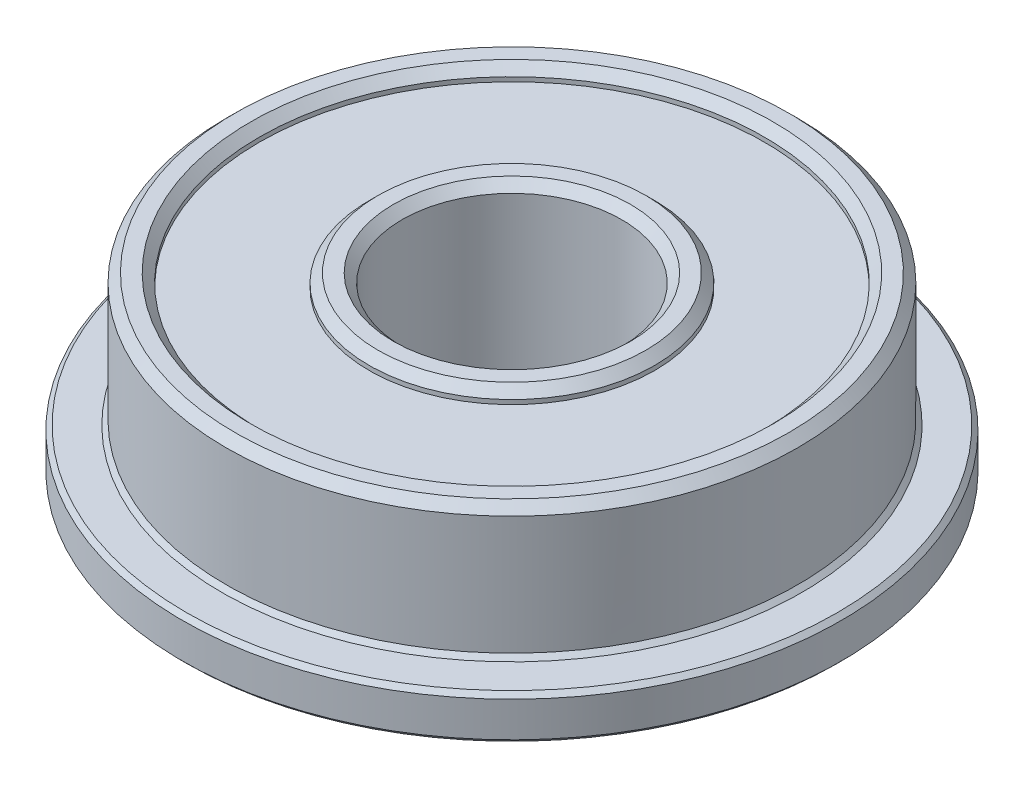
ISO-10303-21;
HEADER;
FILE_DESCRIPTION(('STEP AP214'),'2;1');
FILE_NAME('part.step','',(''),(''),'','','');
FILE_SCHEMA(('AUTOMOTIVE_DESIGN { 1 0 10303 214 1 1 1 1 }'));
ENDSEC;
DATA;
#1=APPLICATION_CONTEXT('core data for automotive mechanical design processes');
#2=APPLICATION_PROTOCOL_DEFINITION('international standard','automotive_design',2000,#1);
#3=PRODUCT_CONTEXT('',#1,'mechanical');
#4=PRODUCT('Part','Part','',(#3));
#5=PRODUCT_RELATED_PRODUCT_CATEGORY('part','',(#4));
#6=PRODUCT_DEFINITION_FORMATION('','',#4);
#7=PRODUCT_DEFINITION_CONTEXT('part definition',#1,'design');
#8=PRODUCT_DEFINITION('design','',#6,#7);
#9=PRODUCT_DEFINITION_SHAPE('','',#8);
#10=(LENGTH_UNIT() NAMED_UNIT(*) SI_UNIT(.MILLI.,.METRE.));
#11=(NAMED_UNIT(*) PLANE_ANGLE_UNIT() SI_UNIT($,.RADIAN.));
#12=(NAMED_UNIT(*) SI_UNIT($,.STERADIAN.) SOLID_ANGLE_UNIT());
#13=UNCERTAINTY_MEASURE_WITH_UNIT(LENGTH_MEASURE(1.E-05),#10,'distance_accuracy_value','');
#14=(GEOMETRIC_REPRESENTATION_CONTEXT(3) GLOBAL_UNCERTAINTY_ASSIGNED_CONTEXT((#13)) GLOBAL_UNIT_ASSIGNED_CONTEXT((#10,
#11,#12)) REPRESENTATION_CONTEXT('',''));
#15=CARTESIAN_POINT('',(0.,0.,0.));
#16=DIRECTION('',(0.,0.,1.));
#17=DIRECTION('',(1.,0.,0.));
#18=AXIS2_PLACEMENT_3D('',#15,#16,#17);
#19=CARTESIAN_POINT('',(0.,3.7,0.));
#20=DIRECTION('',(0.,1.,0.));
#21=DIRECTION('',(0.,0.,-1.));
#22=AXIS2_PLACEMENT_3D('',#19,#20,#21);
#23=PLANE('',#22);
#24=CARTESIAN_POINT('',(0.,3.7,0.));
#25=DIRECTION('',(0.,1.,0.));
#26=DIRECTION('',(-1.,0.,0.));
#27=AXIS2_PLACEMENT_3D('',#24,#25,#26);
#28=CIRCLE('',#27,3.25);
#29=CARTESIAN_POINT('',(3.25,3.7,0.));
#30=VERTEX_POINT('',#29);
#31=EDGE_CURVE('E133',#30,#30,#28,.T.);
#32=ORIENTED_EDGE('',*,*,#31,.F.);
#33=EDGE_LOOP('',(#32));
#34=FACE_BOUND('',#33,.T.);
#35=CARTESIAN_POINT('',(0.,3.7,0.));
#36=DIRECTION('',(0.,-1.,0.));
#37=DIRECTION('',(-1.,0.,0.));
#38=AXIS2_PLACEMENT_3D('',#35,#36,#37);
#39=CIRCLE('',#38,5.75);
#40=CARTESIAN_POINT('',(5.75,3.7,0.));
#41=VERTEX_POINT('',#40);
#42=EDGE_CURVE('E125',#41,#41,#39,.T.);
#43=ORIENTED_EDGE('',*,*,#42,.F.);
#44=EDGE_LOOP('',(#43));
#45=FACE_BOUND('',#44,.T.);
#46=ADVANCED_FACE('F18',(#34,#45),#23,.T.);
#47=CARTESIAN_POINT('',(0.,3.9,0.));
#48=DIRECTION('',(0.,1.,0.));
#49=DIRECTION('',(-1.,0.,0.));
#50=AXIS2_PLACEMENT_3D('',#47,#48,#49);
#51=CONICAL_SURFACE('',#50,2.6,0.785398163397448);
#52=CARTESIAN_POINT('',(0.,3.8,0.));
#53=DIRECTION('',(0.,-1.,0.));
#54=DIRECTION('',(-1.,0.,0.));
#55=AXIS2_PLACEMENT_3D('',#52,#53,#54);
#56=CIRCLE('',#55,2.5);
#57=CARTESIAN_POINT('',(2.5,3.8,0.));
#58=VERTEX_POINT('',#57);
#59=EDGE_CURVE('E462',#58,#58,#56,.T.);
#60=ORIENTED_EDGE('',*,*,#59,.T.);
#61=DIRECTION('',(0.707106781186547,0.707106781186548,0.));
#62=VECTOR('',#61,1.);
#63=CARTESIAN_POINT('',(2.6,3.9,0.));
#64=LINE('',#63,#62);
#65=CARTESIAN_POINT('',(2.7,4.,0.));
#66=VERTEX_POINT('',#65);
#67=EDGE_CURVE('E11',#58,#66,#64,.T.);
#68=ORIENTED_EDGE('',*,*,#67,.T.);
#69=CARTESIAN_POINT('',(0.,4.,0.));
#70=DIRECTION('',(0.,1.,0.));
#71=DIRECTION('',(-1.,0.,0.));
#72=AXIS2_PLACEMENT_3D('',#69,#70,#71);
#73=CIRCLE('',#72,2.7);
#74=EDGE_CURVE('E147',#66,#66,#73,.T.);
#75=ORIENTED_EDGE('',*,*,#74,.T.);
#76=ORIENTED_EDGE('',*,*,#67,.F.);
#77=EDGE_LOOP('',(#60,#68,#75,#76));
#78=FACE_BOUND('',#77,.T.);
#79=ADVANCED_FACE('F353',(#78),#51,.F.);
#80=CARTESIAN_POINT('',(0.,4.,0.));
#81=DIRECTION('',(0.,-1.,0.));
#82=DIRECTION('',(-1.,0.,0.));
#83=AXIS2_PLACEMENT_3D('',#80,#81,#82);
#84=CYLINDRICAL_SURFACE('',#83,3.25);
#85=ORIENTED_EDGE('',*,*,#31,.T.);
#86=DIRECTION('',(0.,1.,0.));
#87=VECTOR('',#86,1.);
#88=CARTESIAN_POINT('',(3.25,4.,0.));
#89=LINE('',#88,#87);
#90=CARTESIAN_POINT('',(3.25,3.8,0.));
#91=VERTEX_POINT('',#90);
#92=EDGE_CURVE('E27',#30,#91,#89,.T.);
#93=ORIENTED_EDGE('',*,*,#92,.T.);
#94=CARTESIAN_POINT('',(0.,3.8,0.));
#95=DIRECTION('',(0.,1.,0.));
#96=DIRECTION('',(-1.,0.,0.));
#97=AXIS2_PLACEMENT_3D('',#94,#95,#96);
#98=CIRCLE('',#97,3.25);
#99=EDGE_CURVE('E131',#91,#91,#98,.T.);
#100=ORIENTED_EDGE('',*,*,#99,.F.);
#101=ORIENTED_EDGE('',*,*,#92,.F.);
#102=EDGE_LOOP('',(#85,#93,#100,#101));
#103=FACE_BOUND('',#102,.T.);
#104=ADVANCED_FACE('F129',(#103),#84,.T.);
#105=CARTESIAN_POINT('',(0.,4.,0.));
#106=DIRECTION('',(0.,1.,0.));
#107=DIRECTION('',(0.,0.,-1.));
#108=AXIS2_PLACEMENT_3D('',#105,#106,#107);
#109=PLANE('',#108);
#110=ORIENTED_EDGE('',*,*,#74,.F.);
#111=EDGE_LOOP('',(#110));
#112=FACE_BOUND('',#111,.T.);
#113=CARTESIAN_POINT('',(0.,4.,0.));
#114=DIRECTION('',(0.,-1.,0.));
#115=DIRECTION('',(-1.,0.,0.));
#116=AXIS2_PLACEMENT_3D('',#113,#114,#115);
#117=CIRCLE('',#116,3.05);
#118=CARTESIAN_POINT('',(3.05,4.,0.));
#119=VERTEX_POINT('',#118);
#120=EDGE_CURVE('E140',#119,#119,#117,.T.);
#121=ORIENTED_EDGE('',*,*,#120,.F.);
#122=EDGE_LOOP('',(#121));
#123=FACE_BOUND('',#122,.T.);
#124=ADVANCED_FACE('F337',(#112,#123),#109,.T.);
#125=CARTESIAN_POINT('',(0.,3.9,0.));
#126=DIRECTION('',(0.,-1.,0.));
#127=DIRECTION('',(-1.,0.,0.));
#128=AXIS2_PLACEMENT_3D('',#125,#126,#127);
#129=CONICAL_SURFACE('',#128,3.15,0.785398163397448);
#130=ORIENTED_EDGE('',*,*,#99,.T.);
#131=DIRECTION('',(-0.707106781186547,0.707106781186548,0.));
#132=VECTOR('',#131,1.);
#133=CARTESIAN_POINT('',(3.15,3.9,0.));
#134=LINE('',#133,#132);
#135=EDGE_CURVE('E137',#91,#119,#134,.T.);
#136=ORIENTED_EDGE('',*,*,#135,.T.);
#137=ORIENTED_EDGE('',*,*,#120,.T.);
#138=ORIENTED_EDGE('',*,*,#135,.F.);
#139=EDGE_LOOP('',(#130,#136,#137,#138));
#140=FACE_BOUND('',#139,.T.);
#141=ADVANCED_FACE('F138',(#140),#129,.T.);
#142=CARTESIAN_POINT('',(0.,4.,0.));
#143=DIRECTION('',(0.,-1.,0.));
#144=DIRECTION('',(-1.,0.,0.));
#145=AXIS2_PLACEMENT_3D('',#142,#143,#144);
#146=CYLINDRICAL_SURFACE('',#145,5.75);
#147=CARTESIAN_POINT('',(0.,3.8,0.));
#148=DIRECTION('',(0.,-1.,0.));
#149=DIRECTION('',(-1.,0.,0.));
#150=AXIS2_PLACEMENT_3D('',#147,#148,#149);
#151=CIRCLE('',#150,5.75);
#152=CARTESIAN_POINT('',(5.75,3.8,0.));
#153=VERTEX_POINT('',#152);
#154=EDGE_CURVE('E425',#153,#153,#151,.T.);
#155=ORIENTED_EDGE('',*,*,#154,.F.);
#156=DIRECTION('',(0.,-1.,0.));
#157=VECTOR('',#156,1.);
#158=CARTESIAN_POINT('',(5.75,4.,0.));
#159=LINE('',#158,#157);
#160=EDGE_CURVE('E424',#153,#41,#159,.T.);
#161=ORIENTED_EDGE('',*,*,#160,.T.);
#162=ORIENTED_EDGE('',*,*,#42,.T.);
#163=ORIENTED_EDGE('',*,*,#160,.F.);
#164=EDGE_LOOP('',(#155,#161,#162,#163));
#165=FACE_BOUND('',#164,.T.);
#166=ADVANCED_FACE('F321',(#165),#146,.F.);
#167=CARTESIAN_POINT('',(0.,3.9,0.));
#168=DIRECTION('',(0.,1.,0.));
#169=DIRECTION('',(-1.,0.,0.));
#170=AXIS2_PLACEMENT_3D('',#167,#168,#169);
#171=CONICAL_SURFACE('',#170,5.85,0.785398163397448);
#172=ORIENTED_EDGE('',*,*,#154,.T.);
#173=DIRECTION('',(0.707106781186547,0.707106781186548,0.));
#174=VECTOR('',#173,1.);
#175=CARTESIAN_POINT('',(5.85,3.9,0.));
#176=LINE('',#175,#174);
#177=CARTESIAN_POINT('',(5.95,4.,0.));
#178=VERTEX_POINT('',#177);
#179=EDGE_CURVE('E421',#153,#178,#176,.T.);
#180=ORIENTED_EDGE('',*,*,#179,.T.);
#181=CARTESIAN_POINT('',(0.,4.,0.));
#182=DIRECTION('',(0.,1.,0.));
#183=DIRECTION('',(-1.,0.,0.));
#184=AXIS2_PLACEMENT_3D('',#181,#182,#183);
#185=CIRCLE('',#184,5.95);
#186=EDGE_CURVE('E499',#178,#178,#185,.T.);
#187=ORIENTED_EDGE('',*,*,#186,.T.);
#188=ORIENTED_EDGE('',*,*,#179,.F.);
#189=EDGE_LOOP('',(#172,#180,#187,#188));
#190=FACE_BOUND('',#189,.T.);
#191=ADVANCED_FACE('F312',(#190),#171,.F.);
#192=CARTESIAN_POINT('',(0.,4.,0.));
#193=DIRECTION('',(0.,1.,0.));
#194=DIRECTION('',(0.,0.,-1.));
#195=AXIS2_PLACEMENT_3D('',#192,#193,#194);
#196=PLANE('',#195);
#197=ORIENTED_EDGE('',*,*,#186,.F.);
#198=EDGE_LOOP('',(#197));
#199=FACE_BOUND('',#198,.T.);
#200=CARTESIAN_POINT('',(0.,4.,0.));
#201=DIRECTION('',(0.,-1.,0.));
#202=DIRECTION('',(-1.,0.,0.));
#203=AXIS2_PLACEMENT_3D('',#200,#201,#202);
#204=CIRCLE('',#203,6.3);
#205=CARTESIAN_POINT('',(6.3,4.,0.));
#206=VERTEX_POINT('',#205);
#207=EDGE_CURVE('E496',#206,#206,#204,.T.);
#208=ORIENTED_EDGE('',*,*,#207,.F.);
#209=EDGE_LOOP('',(#208));
#210=FACE_BOUND('',#209,.T.);
#211=ADVANCED_FACE('F303',(#199,#210),#196,.T.);
#212=CARTESIAN_POINT('',(0.,3.9,0.));
#213=DIRECTION('',(0.,-1.,0.));
#214=DIRECTION('',(-1.,0.,0.));
#215=AXIS2_PLACEMENT_3D('',#212,#213,#214);
#216=CONICAL_SURFACE('',#215,6.4,0.785398163397448);
#217=CARTESIAN_POINT('',(0.,3.8,0.));
#218=DIRECTION('',(0.,1.,0.));
#219=DIRECTION('',(-1.,0.,0.));
#220=AXIS2_PLACEMENT_3D('',#217,#218,#219);
#221=CIRCLE('',#220,6.5);
#222=CARTESIAN_POINT('',(6.5,3.8,0.));
#223=VERTEX_POINT('',#222);
#224=CARTESIAN_POINT('',(-6.5,3.8,0.));
#225=VERTEX_POINT('',#224);
#226=EDGE_CURVE('E402',#223,#225,#221,.T.);
#227=ORIENTED_EDGE('',*,*,#226,.T.);
#228=CARTESIAN_POINT('',(0.,3.8,0.));
#229=DIRECTION('',(0.,1.,0.));
#230=DIRECTION('',(-1.,0.,0.));
#231=AXIS2_PLACEMENT_3D('',#228,#229,#230);
#232=CIRCLE('',#231,6.5);
#233=EDGE_CURVE('E388',#225,#223,#232,.T.);
#234=ORIENTED_EDGE('',*,*,#233,.T.);
#235=DIRECTION('',(-0.707106781186547,0.707106781186548,0.));
#236=VECTOR('',#235,1.);
#237=CARTESIAN_POINT('',(6.4,3.9,0.));
#238=LINE('',#237,#236);
#239=EDGE_CURVE('E492',#223,#206,#238,.T.);
#240=ORIENTED_EDGE('',*,*,#239,.T.);
#241=ORIENTED_EDGE('',*,*,#207,.T.);
#242=ORIENTED_EDGE('',*,*,#239,.F.);
#243=EDGE_LOOP('',(#227,#234,#240,#241,#242));
#244=FACE_BOUND('',#243,.T.);
#245=ADVANCED_FACE('F261',(#244),#216,.T.);
#246=CARTESIAN_POINT('',(0.,0.3,0.));
#247=DIRECTION('',(0.,-1.,0.));
#248=DIRECTION('',(0.,0.,-1.));
#249=AXIS2_PLACEMENT_3D('',#246,#247,#248);
#250=PLANE('',#249);
#251=CARTESIAN_POINT('',(0.,0.3,0.));
#252=DIRECTION('',(0.,-1.,0.));
#253=DIRECTION('',(1.,0.,0.));
#254=AXIS2_PLACEMENT_3D('',#251,#252,#253);
#255=CIRCLE('',#254,3.25);
#256=CARTESIAN_POINT('',(-3.25,0.3,0.));
#257=VERTEX_POINT('',#256);
#258=EDGE_CURVE('E476',#257,#257,#255,.T.);
#259=ORIENTED_EDGE('',*,*,#258,.F.);
#260=EDGE_LOOP('',(#259));
#261=FACE_BOUND('',#260,.T.);
#262=CARTESIAN_POINT('',(0.,0.3,0.));
#263=DIRECTION('',(0.,1.,0.));
#264=DIRECTION('',(1.,0.,0.));
#265=AXIS2_PLACEMENT_3D('',#262,#263,#264);
#266=CIRCLE('',#265,5.75);
#267=CARTESIAN_POINT('',(-5.75,0.3,0.));
#268=VERTEX_POINT('',#267);
#269=EDGE_CURVE('E489',#268,#268,#266,.T.);
#270=ORIENTED_EDGE('',*,*,#269,.F.);
#271=EDGE_LOOP('',(#270));
#272=FACE_BOUND('',#271,.T.);
#273=ADVANCED_FACE('F188',(#261,#272),#250,.T.);
#274=CARTESIAN_POINT('',(0.,0.,0.));
#275=DIRECTION('',(0.,1.,0.));
#276=DIRECTION('',(1.,0.,0.));
#277=AXIS2_PLACEMENT_3D('',#274,#275,#276);
#278=CYLINDRICAL_SURFACE('',#277,5.75);
#279=CARTESIAN_POINT('',(0.,0.2,0.));
#280=DIRECTION('',(0.,1.,0.));
#281=DIRECTION('',(1.,0.,0.));
#282=AXIS2_PLACEMENT_3D('',#279,#280,#281);
#283=CIRCLE('',#282,5.75);
#284=CARTESIAN_POINT('',(-5.75,0.2,0.));
#285=VERTEX_POINT('',#284);
#286=EDGE_CURVE('E412',#285,#285,#283,.T.);
#287=ORIENTED_EDGE('',*,*,#286,.F.);
#288=DIRECTION('',(0.,1.,0.));
#289=VECTOR('',#288,1.);
#290=CARTESIAN_POINT('',(-5.75,0.,0.));
#291=LINE('',#290,#289);
#292=EDGE_CURVE('E411',#285,#268,#291,.T.);
#293=ORIENTED_EDGE('',*,*,#292,.T.);
#294=ORIENTED_EDGE('',*,*,#269,.T.);
#295=ORIENTED_EDGE('',*,*,#292,.F.);
#296=EDGE_LOOP('',(#287,#293,#294,#295));
#297=FACE_BOUND('',#296,.T.);
#298=ADVANCED_FACE('F183',(#297),#278,.F.);
#299=CARTESIAN_POINT('',(0.,0.1,0.));
#300=DIRECTION('',(0.,-1.,0.));
#301=DIRECTION('',(1.,0.,0.));
#302=AXIS2_PLACEMENT_3D('',#299,#300,#301);
#303=CONICAL_SURFACE('',#302,5.85,0.785398163397449);
#304=ORIENTED_EDGE('',*,*,#286,.T.);
#305=DIRECTION('',(-0.707106781186548,-0.707106781186547,0.));
#306=VECTOR('',#305,1.);
#307=CARTESIAN_POINT('',(-5.85,0.1,0.));
#308=LINE('',#307,#306);
#309=CARTESIAN_POINT('',(-5.95,0.,0.));
#310=VERTEX_POINT('',#309);
#311=EDGE_CURVE('E409',#285,#310,#308,.T.);
#312=ORIENTED_EDGE('',*,*,#311,.T.);
#313=CARTESIAN_POINT('',(0.,0.,0.));
#314=DIRECTION('',(0.,-1.,0.));
#315=DIRECTION('',(1.,0.,0.));
#316=AXIS2_PLACEMENT_3D('',#313,#314,#315);
#317=CIRCLE('',#316,5.95);
#318=EDGE_CURVE('E413',#310,#310,#317,.T.);
#319=ORIENTED_EDGE('',*,*,#318,.T.);
#320=ORIENTED_EDGE('',*,*,#311,.F.);
#321=EDGE_LOOP('',(#304,#312,#319,#320));
#322=FACE_BOUND('',#321,.T.);
#323=ADVANCED_FACE('F187',(#322),#303,.F.);
#324=CARTESIAN_POINT('',(0.,0.,0.));
#325=DIRECTION('',(0.,1.,0.));
#326=DIRECTION('',(1.,0.,0.));
#327=AXIS2_PLACEMENT_3D('',#324,#325,#326);
#328=CYLINDRICAL_SURFACE('',#327,3.25);
#329=ORIENTED_EDGE('',*,*,#258,.T.);
#330=DIRECTION('',(0.,-1.,0.));
#331=VECTOR('',#330,1.);
#332=CARTESIAN_POINT('',(-3.25,0.,0.));
#333=LINE('',#332,#331);
#334=CARTESIAN_POINT('',(-3.25,0.2,0.));
#335=VERTEX_POINT('',#334);
#336=EDGE_CURVE('E480',#257,#335,#333,.T.);
#337=ORIENTED_EDGE('',*,*,#336,.T.);
#338=CARTESIAN_POINT('',(0.,0.2,0.));
#339=DIRECTION('',(0.,-1.,0.));
#340=DIRECTION('',(1.,0.,0.));
#341=AXIS2_PLACEMENT_3D('',#338,#339,#340);
#342=CIRCLE('',#341,3.25);
#343=EDGE_CURVE('E469',#335,#335,#342,.T.);
#344=ORIENTED_EDGE('',*,*,#343,.F.);
#345=ORIENTED_EDGE('',*,*,#336,.F.);
#346=EDGE_LOOP('',(#329,#337,#344,#345));
#347=FACE_BOUND('',#346,.T.);
#348=ADVANCED_FACE('F278',(#347),#328,.T.);
#349=CARTESIAN_POINT('',(0.,0.1,0.));
#350=DIRECTION('',(0.,1.,0.));
#351=DIRECTION('',(1.,0.,0.));
#352=AXIS2_PLACEMENT_3D('',#349,#350,#351);
#353=CONICAL_SURFACE('',#352,3.15,0.785398163397449);
#354=ORIENTED_EDGE('',*,*,#343,.T.);
#355=DIRECTION('',(0.707106781186548,-0.707106781186547,0.));
#356=VECTOR('',#355,1.);
#357=CARTESIAN_POINT('',(-3.15,0.1,0.));
#358=LINE('',#357,#356);
#359=CARTESIAN_POINT('',(-3.05,0.,0.));
#360=VERTEX_POINT('',#359);
#361=EDGE_CURVE('E473',#335,#360,#358,.T.);
#362=ORIENTED_EDGE('',*,*,#361,.T.);
#363=CARTESIAN_POINT('',(0.,0.,0.));
#364=DIRECTION('',(0.,1.,0.));
#365=DIRECTION('',(1.,0.,0.));
#366=AXIS2_PLACEMENT_3D('',#363,#364,#365);
#367=CIRCLE('',#366,3.05);
#368=EDGE_CURVE('E458',#360,#360,#367,.T.);
#369=ORIENTED_EDGE('',*,*,#368,.T.);
#370=ORIENTED_EDGE('',*,*,#361,.F.);
#371=EDGE_LOOP('',(#354,#362,#369,#370));
#372=FACE_BOUND('',#371,.T.);
#373=ADVANCED_FACE('F199',(#372),#353,.T.);
#374=CARTESIAN_POINT('',(0.,4.,0.));
#375=DIRECTION('',(0.,-1.,0.));
#376=DIRECTION('',(-1.,0.,0.));
#377=AXIS2_PLACEMENT_3D('',#374,#375,#376);
#378=CYLINDRICAL_SURFACE('',#377,2.5);
#379=ORIENTED_EDGE('',*,*,#59,.F.);
#380=DIRECTION('',(0.,-1.,0.));
#381=VECTOR('',#380,1.);
#382=CARTESIAN_POINT('',(2.5,4.,0.));
#383=LINE('',#382,#381);
#384=CARTESIAN_POINT('',(2.5,0.2,0.));
#385=VERTEX_POINT('',#384);
#386=EDGE_CURVE('E466',#58,#385,#383,.T.);
#387=ORIENTED_EDGE('',*,*,#386,.T.);
#388=CARTESIAN_POINT('',(0.,0.2,0.));
#389=DIRECTION('',(0.,1.,0.));
#390=DIRECTION('',(-1.,0.,0.));
#391=AXIS2_PLACEMENT_3D('',#388,#389,#390);
#392=CIRCLE('',#391,2.5);
#393=EDGE_CURVE('E416',#385,#385,#392,.T.);
#394=ORIENTED_EDGE('',*,*,#393,.F.);
#395=ORIENTED_EDGE('',*,*,#386,.F.);
#396=EDGE_LOOP('',(#379,#387,#394,#395));
#397=FACE_BOUND('',#396,.T.);
#398=ADVANCED_FACE('F194',(#397),#378,.F.);
#399=CARTESIAN_POINT('',(0.,0.,0.));
#400=DIRECTION('',(0.,-1.,0.));
#401=DIRECTION('',(0.,0.,-1.));
#402=AXIS2_PLACEMENT_3D('',#399,#400,#401);
#403=PLANE('',#402);
#404=CARTESIAN_POINT('',(0.,0.,0.));
#405=DIRECTION('',(0.,-1.,0.));
#406=DIRECTION('',(-1.,0.,0.));
#407=AXIS2_PLACEMENT_3D('',#404,#405,#406);
#408=CIRCLE('',#407,2.7);
#409=CARTESIAN_POINT('',(2.7,0.,0.));
#410=VERTEX_POINT('',#409);
#411=EDGE_CURVE('E455',#410,#410,#408,.T.);
#412=ORIENTED_EDGE('',*,*,#411,.F.);
#413=EDGE_LOOP('',(#412));
#414=FACE_BOUND('',#413,.T.);
#415=ORIENTED_EDGE('',*,*,#368,.F.);
#416=EDGE_LOOP('',(#415));
#417=FACE_BOUND('',#416,.T.);
#418=ADVANCED_FACE('F198',(#414,#417),#403,.T.);
#419=CARTESIAN_POINT('',(0.,0.1,0.));
#420=DIRECTION('',(0.,-1.,0.));
#421=DIRECTION('',(-1.,0.,0.));
#422=AXIS2_PLACEMENT_3D('',#419,#420,#421);
#423=CONICAL_SURFACE('',#422,2.6,0.785398163397448);
#424=ORIENTED_EDGE('',*,*,#393,.T.);
#425=DIRECTION('',(0.707106781186547,-0.707106781186548,0.));
#426=VECTOR('',#425,1.);
#427=CARTESIAN_POINT('',(2.6,0.1,0.));
#428=LINE('',#427,#426);
#429=EDGE_CURVE('E438',#385,#410,#428,.T.);
#430=ORIENTED_EDGE('',*,*,#429,.T.);
#431=ORIENTED_EDGE('',*,*,#411,.T.);
#432=ORIENTED_EDGE('',*,*,#429,.F.);
#433=EDGE_LOOP('',(#424,#430,#431,#432));
#434=FACE_BOUND('',#433,.T.);
#435=ADVANCED_FACE('F235',(#434),#423,.F.);
#436=CARTESIAN_POINT('',(0.,0.,0.));
#437=DIRECTION('',(0.,-1.,0.));
#438=DIRECTION('',(0.,0.,-1.));
#439=AXIS2_PLACEMENT_3D('',#436,#437,#438);
#440=PLANE('',#439);
#441=ORIENTED_EDGE('',*,*,#318,.F.);
#442=EDGE_LOOP('',(#441));
#443=FACE_BOUND('',#442,.T.);
#444=CARTESIAN_POINT('',(0.,0.,0.));
#445=DIRECTION('',(0.,1.,0.));
#446=DIRECTION('',(1.,0.,0.));
#447=AXIS2_PLACEMENT_3D('',#444,#445,#446);
#448=CIRCLE('',#447,7.4);
#449=CARTESIAN_POINT('',(-7.4,0.,0.));
#450=VERTEX_POINT('',#449);
#451=EDGE_CURVE('E417',#450,#450,#448,.T.);
#452=ORIENTED_EDGE('',*,*,#451,.F.);
#453=EDGE_LOOP('',(#452));
#454=FACE_BOUND('',#453,.T.);
#455=ADVANCED_FACE('F244',(#443,#454),#440,.T.);
#456=CARTESIAN_POINT('',(0.,0.05,0.));
#457=DIRECTION('',(0.,1.,0.));
#458=DIRECTION('',(1.,0.,0.));
#459=AXIS2_PLACEMENT_3D('',#456,#457,#458);
#460=CONICAL_SURFACE('',#459,7.45,0.785398163397449);
#461=CARTESIAN_POINT('',(0.,0.1,0.));
#462=DIRECTION('',(0.,-1.,0.));
#463=DIRECTION('',(1.,0.,0.));
#464=AXIS2_PLACEMENT_3D('',#461,#462,#463);
#465=CIRCLE('',#464,7.5);
#466=CARTESIAN_POINT('',(-7.5,0.1,0.));
#467=VERTEX_POINT('',#466);
#468=EDGE_CURVE('E442',#467,#467,#465,.T.);
#469=ORIENTED_EDGE('',*,*,#468,.T.);
#470=DIRECTION('',(0.707106781186548,-0.707106781186547,0.));
#471=VECTOR('',#470,1.);
#472=CARTESIAN_POINT('',(-7.45,0.05,0.));
#473=LINE('',#472,#471);
#474=EDGE_CURVE('E446',#467,#450,#473,.T.);
#475=ORIENTED_EDGE('',*,*,#474,.T.);
#476=ORIENTED_EDGE('',*,*,#451,.T.);
#477=ORIENTED_EDGE('',*,*,#474,.F.);
#478=EDGE_LOOP('',(#469,#475,#476,#477));
#479=FACE_BOUND('',#478,.T.);
#480=ADVANCED_FACE('F210',(#479),#460,.T.);
#481=CARTESIAN_POINT('',(0.,0.,0.));
#482=DIRECTION('',(0.,1.,0.));
#483=DIRECTION('',(1.,0.,0.));
#484=AXIS2_PLACEMENT_3D('',#481,#482,#483);
#485=CYLINDRICAL_SURFACE('',#484,7.5);
#486=CARTESIAN_POINT('',(0.,0.9,0.));
#487=DIRECTION('',(0.,1.,0.));
#488=DIRECTION('',(1.,0.,0.));
#489=AXIS2_PLACEMENT_3D('',#486,#487,#488);
#490=CIRCLE('',#489,7.5);
#491=CARTESIAN_POINT('',(-7.5,0.9,0.));
#492=VERTEX_POINT('',#491);
#493=EDGE_CURVE('E391',#492,#492,#490,.T.);
#494=ORIENTED_EDGE('',*,*,#493,.F.);
#495=DIRECTION('',(0.,-1.,0.));
#496=VECTOR('',#495,1.);
#497=CARTESIAN_POINT('',(-7.5,0.,0.));
#498=LINE('',#497,#496);
#499=EDGE_CURVE('E434',#492,#467,#498,.T.);
#500=ORIENTED_EDGE('',*,*,#499,.T.);
#501=ORIENTED_EDGE('',*,*,#468,.F.);
#502=ORIENTED_EDGE('',*,*,#499,.F.);
#503=EDGE_LOOP('',(#494,#500,#501,#502));
#504=FACE_BOUND('',#503,.T.);
#505=ADVANCED_FACE('F205',(#504),#485,.T.);
#506=CARTESIAN_POINT('',(0.,0.95,0.));
#507=DIRECTION('',(0.,-1.,0.));
#508=DIRECTION('',(1.,0.,0.));
#509=AXIS2_PLACEMENT_3D('',#506,#507,#508);
#510=CONICAL_SURFACE('',#509,7.45,0.785398163397448);
#511=ORIENTED_EDGE('',*,*,#493,.T.);
#512=DIRECTION('',(0.707106781186547,0.707106781186548,0.));
#513=VECTOR('',#512,1.);
#514=CARTESIAN_POINT('',(-7.45,0.95,0.));
#515=LINE('',#514,#513);
#516=CARTESIAN_POINT('',(-7.4,1.,0.));
#517=VERTEX_POINT('',#516);
#518=EDGE_CURVE('E431',#492,#517,#515,.T.);
#519=ORIENTED_EDGE('',*,*,#518,.T.);
#520=CARTESIAN_POINT('',(0.,1.,0.));
#521=DIRECTION('',(0.,-1.,0.));
#522=DIRECTION('',(1.,0.,0.));
#523=AXIS2_PLACEMENT_3D('',#520,#521,#522);
#524=CIRCLE('',#523,7.4);
#525=EDGE_CURVE('E396',#517,#517,#524,.T.);
#526=ORIENTED_EDGE('',*,*,#525,.T.);
#527=ORIENTED_EDGE('',*,*,#518,.F.);
#528=EDGE_LOOP('',(#511,#519,#526,#527));
#529=FACE_BOUND('',#528,.T.);
#530=ADVANCED_FACE('F209',(#529),#510,.T.);
#531=CARTESIAN_POINT('',(0.,2.,0.));
#532=DIRECTION('',(0.,1.,0.));
#533=DIRECTION('',(1.,0.,0.));
#534=AXIS2_PLACEMENT_3D('',#531,#532,#533);
#535=CYLINDRICAL_SURFACE('',#534,6.5);
#536=ORIENTED_EDGE('',*,*,#226,.F.);
#537=ORIENTED_EDGE('',*,*,#233,.F.);
#538=DIRECTION('',(0.,-1.,0.));
#539=VECTOR('',#538,1.);
#540=CARTESIAN_POINT('',(-6.5,2.,0.));
#541=LINE('',#540,#539);
#542=CARTESIAN_POINT('',(-6.5,1.1,0.));
#543=VERTEX_POINT('',#542);
#544=EDGE_CURVE('E382',#225,#543,#541,.T.);
#545=ORIENTED_EDGE('',*,*,#544,.T.);
#546=CARTESIAN_POINT('',(0.,1.1,0.));
#547=DIRECTION('',(0.,-1.,0.));
#548=DIRECTION('',(1.,0.,0.));
#549=AXIS2_PLACEMENT_3D('',#546,#547,#548);
#550=CIRCLE('',#549,6.5);
#551=EDGE_CURVE('E385',#543,#543,#550,.T.);
#552=ORIENTED_EDGE('',*,*,#551,.F.);
#553=ORIENTED_EDGE('',*,*,#544,.F.);
#554=EDGE_LOOP('',(#536,#537,#545,#552,#553));
#555=FACE_BOUND('',#554,.T.);
#556=ADVANCED_FACE('F177',(#555),#535,.T.);
#557=CARTESIAN_POINT('',(0.,1.,0.));
#558=DIRECTION('',(0.,1.,0.));
#559=DIRECTION('',(1.,0.,0.));
#560=AXIS2_PLACEMENT_3D('',#557,#558,#559);
#561=PLANE('',#560);
#562=CARTESIAN_POINT('',(0.,1.,0.));
#563=DIRECTION('',(0.,1.,0.));
#564=DIRECTION('',(1.,0.,0.));
#565=AXIS2_PLACEMENT_3D('',#562,#563,#564);
#566=CIRCLE('',#565,6.6);
#567=CARTESIAN_POINT('',(-6.6,1.,0.));
#568=VERTEX_POINT('',#567);
#569=EDGE_CURVE('E405',#568,#568,#566,.T.);
#570=ORIENTED_EDGE('',*,*,#569,.F.);
#571=EDGE_LOOP('',(#570));
#572=FACE_BOUND('',#571,.T.);
#573=ORIENTED_EDGE('',*,*,#525,.F.);
#574=EDGE_LOOP('',(#573));
#575=FACE_BOUND('',#574,.T.);
#576=ADVANCED_FACE('F167',(#572,#575),#561,.T.);
#577=CARTESIAN_POINT('',(0.,1.05,0.));
#578=DIRECTION('',(0.,-1.,0.));
#579=DIRECTION('',(1.,0.,0.));
#580=AXIS2_PLACEMENT_3D('',#577,#578,#579);
#581=CONICAL_SURFACE('',#580,6.55,0.785398163397448);
#582=ORIENTED_EDGE('',*,*,#569,.T.);
#583=DIRECTION('',(0.707106781186547,0.707106781186548,0.));
#584=VECTOR('',#583,1.);
#585=CARTESIAN_POINT('',(-6.55,1.05,0.));
#586=LINE('',#585,#584);
#587=EDGE_CURVE('E394',#568,#543,#586,.T.);
#588=ORIENTED_EDGE('',*,*,#587,.T.);
#589=ORIENTED_EDGE('',*,*,#551,.T.);
#590=ORIENTED_EDGE('',*,*,#587,.F.);
#591=EDGE_LOOP('',(#582,#588,#589,#590));
#592=FACE_BOUND('',#591,.T.);
#593=ADVANCED_FACE('F162',(#592),#581,.T.);
#594=CLOSED_SHELL('',(#46,#79,#104,#124,#141,#166,#191,#211,#245,#273,#298,#323,#348,#373,#398,
#418,#435,#455,#480,#505,#530,#556,#576,#593));
#595=MANIFOLD_SOLID_BREP('B1',#594);
#596=ADVANCED_BREP_SHAPE_REPRESENTATION('',(#18,#595),#14);
#597=SHAPE_DEFINITION_REPRESENTATION(#9,#596);
ENDSEC;
END-ISO-10303-21;
